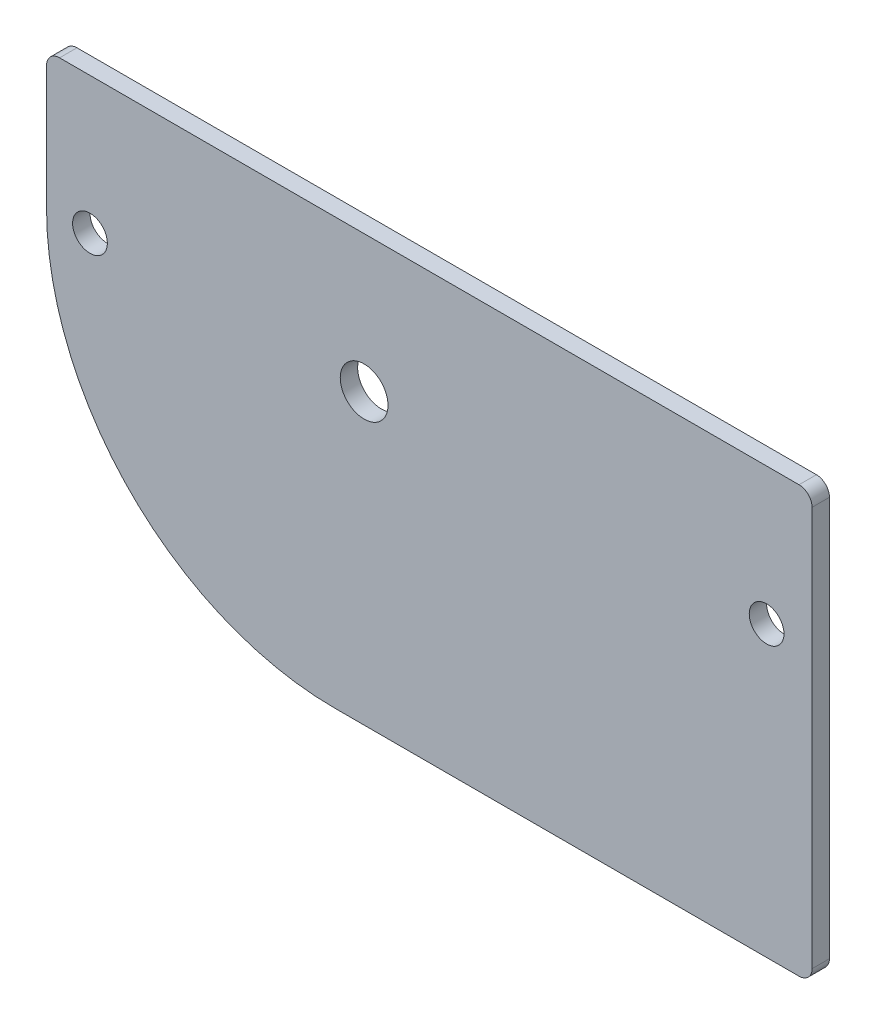
ISO-10303-21;
HEADER;
FILE_DESCRIPTION(('STEP AP214'),'2;1');
FILE_NAME('part.step','',(''),(''),'','','');
FILE_SCHEMA(('AUTOMOTIVE_DESIGN { 1 0 10303 214 1 1 1 1 }'));
ENDSEC;
DATA;
#1=APPLICATION_CONTEXT('core data for automotive mechanical design processes');
#2=APPLICATION_PROTOCOL_DEFINITION('international standard','automotive_design',2000,#1);
#3=PRODUCT_CONTEXT('',#1,'mechanical');
#4=PRODUCT('Part','Part','',(#3));
#5=PRODUCT_RELATED_PRODUCT_CATEGORY('part','',(#4));
#6=PRODUCT_DEFINITION_FORMATION('','',#4);
#7=PRODUCT_DEFINITION_CONTEXT('part definition',#1,'design');
#8=PRODUCT_DEFINITION('design','',#6,#7);
#9=PRODUCT_DEFINITION_SHAPE('','',#8);
#10=(LENGTH_UNIT() NAMED_UNIT(*) SI_UNIT(.MILLI.,.METRE.));
#11=(NAMED_UNIT(*) PLANE_ANGLE_UNIT() SI_UNIT($,.RADIAN.));
#12=(NAMED_UNIT(*) SI_UNIT($,.STERADIAN.) SOLID_ANGLE_UNIT());
#13=UNCERTAINTY_MEASURE_WITH_UNIT(LENGTH_MEASURE(1.E-05),#10,'distance_accuracy_value','');
#14=(GEOMETRIC_REPRESENTATION_CONTEXT(3) GLOBAL_UNCERTAINTY_ASSIGNED_CONTEXT((#13)) GLOBAL_UNIT_ASSIGNED_CONTEXT((#10,
#11,#12)) REPRESENTATION_CONTEXT('',''));
#15=CARTESIAN_POINT('',(0.,0.,0.));
#16=DIRECTION('',(0.,0.,1.));
#17=DIRECTION('',(1.,0.,0.));
#18=AXIS2_PLACEMENT_3D('',#15,#16,#17);
#19=CARTESIAN_POINT('',(58.5348506088101,-30.464729066858,2.));
#20=DIRECTION('',(0.,1.,0.));
#21=DIRECTION('',(0.,0.,1.));
#22=AXIS2_PLACEMENT_3D('',#19,#20,#21);
#23=PLANE('',#22);
#24=DIRECTION('',(0.,0.,-1.));
#25=VECTOR('',#24,1.);
#26=CARTESIAN_POINT('',(-25.3499377947,-30.464729066858,2.));
#27=LINE('',#26,#25);
#28=CARTESIAN_POINT('',(-25.3499377947,-30.464729066858,2.));
#29=VERTEX_POINT('',#28);
#30=CARTESIAN_POINT('',(-25.3499377947,-30.464729066858,0.));
#31=VERTEX_POINT('',#30);
#32=EDGE_CURVE('E105',#29,#31,#27,.T.);
#33=ORIENTED_EDGE('',*,*,#32,.T.);
#34=DIRECTION('',(1.,0.,0.));
#35=VECTOR('',#34,1.);
#36=CARTESIAN_POINT('',(58.5348506088101,-30.464729066858,0.));
#37=LINE('',#36,#35);
#38=CARTESIAN_POINT('',(28.0913613679258,-30.464729066858,0.));
#39=VERTEX_POINT('',#38);
#40=EDGE_CURVE('E61',#31,#39,#37,.T.);
#41=ORIENTED_EDGE('',*,*,#40,.T.);
#42=DIRECTION('',(0.,0.,-1.));
#43=VECTOR('',#42,1.);
#44=CARTESIAN_POINT('',(28.0913613679258,-30.464729066858,2.));
#45=LINE('',#44,#43);
#46=CARTESIAN_POINT('',(28.0913613679258,-30.464729066858,2.));
#47=VERTEX_POINT('',#46);
#48=EDGE_CURVE('E122',#47,#39,#45,.T.);
#49=ORIENTED_EDGE('',*,*,#48,.F.);
#50=DIRECTION('',(1.,0.,0.));
#51=VECTOR('',#50,1.);
#52=CARTESIAN_POINT('',(58.5348506088101,-30.464729066858,2.));
#53=LINE('',#52,#51);
#54=EDGE_CURVE('E46',#29,#47,#53,.T.);
#55=ORIENTED_EDGE('',*,*,#54,.F.);
#56=EDGE_LOOP('',(#33,#41,#49,#55));
#57=FACE_BOUND('',#56,.T.);
#58=ADVANCED_FACE('F38',(#57),#23,.F.);
#59=CARTESIAN_POINT('',(-58.5348506088101,30.464729066858,2.));
#60=DIRECTION('',(1.,0.,0.));
#61=DIRECTION('',(0.,0.,-1.));
#62=AXIS2_PLACEMENT_3D('',#59,#60,#61);
#63=PLANE('',#62);
#64=DIRECTION('',(0.,-1.,0.));
#65=VECTOR('',#64,1.);
#66=CARTESIAN_POINT('',(-58.5348506088101,30.464729066858,0.));
#67=LINE('',#66,#65);
#68=CARTESIAN_POINT('',(-58.5348506088101,17.035270933142,0.));
#69=VERTEX_POINT('',#68);
#70=CARTESIAN_POINT('',(-58.5348506088101,2.64527154538153,0.));
#71=VERTEX_POINT('',#70);
#72=EDGE_CURVE('E53',#69,#71,#67,.T.);
#73=ORIENTED_EDGE('',*,*,#72,.T.);
#74=DIRECTION('',(0.,0.,-1.));
#75=VECTOR('',#74,1.);
#76=CARTESIAN_POINT('',(-58.5348506088101,2.64527154538153,2.));
#77=LINE('',#76,#75);
#78=CARTESIAN_POINT('',(-58.5348506088101,2.64527154538153,2.));
#79=VERTEX_POINT('',#78);
#80=EDGE_CURVE('E111',#71,#79,#77,.F.);
#81=ORIENTED_EDGE('',*,*,#80,.T.);
#82=DIRECTION('',(0.,-1.,0.));
#83=VECTOR('',#82,1.);
#84=CARTESIAN_POINT('',(-58.5348506088101,30.464729066858,2.));
#85=LINE('',#84,#83);
#86=CARTESIAN_POINT('',(-58.5348506088101,17.035270933142,2.));
#87=VERTEX_POINT('',#86);
#88=EDGE_CURVE('E119',#87,#79,#85,.T.);
#89=ORIENTED_EDGE('',*,*,#88,.F.);
#90=DIRECTION('',(0.,0.,-1.));
#91=VECTOR('',#90,1.);
#92=CARTESIAN_POINT('',(-58.5348506088101,17.035270933142,2.));
#93=LINE('',#92,#91);
#94=EDGE_CURVE('E142',#87,#69,#93,.T.);
#95=ORIENTED_EDGE('',*,*,#94,.T.);
#96=EDGE_LOOP('',(#73,#81,#89,#95));
#97=FACE_BOUND('',#96,.T.);
#98=ADVANCED_FACE('F40',(#97),#63,.F.);
#99=CARTESIAN_POINT('',(0.,0.,2.));
#100=DIRECTION('',(0.,0.,-1.));
#101=DIRECTION('',(-1.,0.,0.));
#102=AXIS2_PLACEMENT_3D('',#99,#100,#101);
#103=PLANE('',#102);
#104=CARTESIAN_POINT('',(24.3575445079259,2.79458492910755,2.));
#105=DIRECTION('',(0.,0.,-1.));
#106=DIRECTION('',(-1.,0.,0.));
#107=AXIS2_PLACEMENT_3D('',#104,#105,#106);
#108=CIRCLE('',#107,2.);
#109=CARTESIAN_POINT('',(22.3575445079259,2.79458492910755,2.));
#110=VERTEX_POINT('',#109);
#111=EDGE_CURVE('E234',#110,#110,#108,.T.);
#112=ORIENTED_EDGE('',*,*,#111,.T.);
#113=EDGE_LOOP('',(#112));
#114=FACE_BOUND('',#113,.T.);
#115=CARTESIAN_POINT('',(-21.9748530502164,2.79526543997796,2.));
#116=DIRECTION('',(0.,0.,-1.));
#117=DIRECTION('',(-1.,0.,0.));
#118=AXIS2_PLACEMENT_3D('',#115,#116,#117);
#119=CIRCLE('',#118,2.75);
#120=CARTESIAN_POINT('',(-24.7248530502164,2.79526543997796,2.));
#121=VERTEX_POINT('',#120);
#122=EDGE_CURVE('E243',#121,#121,#119,.T.);
#123=ORIENTED_EDGE('',*,*,#122,.T.);
#124=EDGE_LOOP('',(#123));
#125=FACE_BOUND('',#124,.T.);
#126=CARTESIAN_POINT('',(-53.5348506088102,2.79458492910755,2.));
#127=DIRECTION('',(0.,0.,-1.));
#128=DIRECTION('',(-1.,0.,0.));
#129=AXIS2_PLACEMENT_3D('',#126,#127,#128);
#130=CIRCLE('',#129,2.);
#131=CARTESIAN_POINT('',(-55.5348506088102,2.79458492910755,2.));
#132=VERTEX_POINT('',#131);
#133=EDGE_CURVE('E120',#132,#132,#130,.T.);
#134=ORIENTED_EDGE('',*,*,#133,.T.);
#135=EDGE_LOOP('',(#134));
#136=FACE_BOUND('',#135,.T.);
#137=ORIENTED_EDGE('',*,*,#88,.T.);
#138=CARTESIAN_POINT('',(-25.3499377947,2.72026849261424,2.));
#139=DIRECTION('',(0.,0.,1.));
#140=DIRECTION('',(-1.,0.,0.));
#141=AXIS2_PLACEMENT_3D('',#138,#139,#140);
#142=CIRCLE('',#141,33.1849975594723);
#143=EDGE_CURVE('E108',#79,#29,#142,.T.);
#144=ORIENTED_EDGE('',*,*,#143,.T.);
#145=ORIENTED_EDGE('',*,*,#54,.T.);
#146=CARTESIAN_POINT('',(28.0913613679258,-28.964729066858,2.));
#147=DIRECTION('',(0.,0.,1.));
#148=DIRECTION('',(-1.,0.,0.));
#149=AXIS2_PLACEMENT_3D('',#146,#147,#148);
#150=CIRCLE('',#149,1.5);
#151=CARTESIAN_POINT('',(29.5913613679258,-28.964729066858,2.));
#152=VERTEX_POINT('',#151);
#153=EDGE_CURVE('E169',#47,#152,#150,.T.);
#154=ORIENTED_EDGE('',*,*,#153,.T.);
#155=DIRECTION('',(0.,1.,0.));
#156=VECTOR('',#155,1.);
#157=CARTESIAN_POINT('',(29.5913613679258,17.035270933142,2.));
#158=LINE('',#157,#156);
#159=CARTESIAN_POINT('',(29.5913613679258,17.035270933142,2.));
#160=VERTEX_POINT('',#159);
#161=EDGE_CURVE('E149',#152,#160,#158,.T.);
#162=ORIENTED_EDGE('',*,*,#161,.T.);
#163=CARTESIAN_POINT('',(28.0913613679258,17.035270933142,2.));
#164=DIRECTION('',(0.,0.,1.));
#165=DIRECTION('',(-1.,0.,0.));
#166=AXIS2_PLACEMENT_3D('',#163,#164,#165);
#167=CIRCLE('',#166,1.5);
#168=CARTESIAN_POINT('',(28.0913613679258,18.535270933142,2.));
#169=VERTEX_POINT('',#168);
#170=EDGE_CURVE('E145',#160,#169,#167,.T.);
#171=ORIENTED_EDGE('',*,*,#170,.T.);
#172=DIRECTION('',(-1.,0.,0.));
#173=VECTOR('',#172,1.);
#174=CARTESIAN_POINT('',(-57.0348506088101,18.535270933142,2.));
#175=LINE('',#174,#173);
#176=CARTESIAN_POINT('',(-57.0348506088101,18.535270933142,2.));
#177=VERTEX_POINT('',#176);
#178=EDGE_CURVE('E143',#169,#177,#175,.T.);
#179=ORIENTED_EDGE('',*,*,#178,.T.);
#180=CARTESIAN_POINT('',(-57.0348506088101,17.035270933142,2.));
#181=DIRECTION('',(0.,0.,1.));
#182=DIRECTION('',(-1.,0.,0.));
#183=AXIS2_PLACEMENT_3D('',#180,#181,#182);
#184=CIRCLE('',#183,1.5);
#185=EDGE_CURVE('E166',#177,#87,#184,.T.);
#186=ORIENTED_EDGE('',*,*,#185,.T.);
#187=EDGE_LOOP('',(#137,#144,#145,#154,#162,#171,#179,#186));
#188=FACE_BOUND('',#187,.T.);
#189=ADVANCED_FACE('F114',(#114,#125,#136,#188),#103,.F.);
#190=CARTESIAN_POINT('',(0.,0.,0.));
#191=DIRECTION('',(0.,0.,-1.));
#192=DIRECTION('',(-1.,0.,0.));
#193=AXIS2_PLACEMENT_3D('',#190,#191,#192);
#194=PLANE('',#193);
#195=CARTESIAN_POINT('',(24.3575445079259,2.79458492910755,0.));
#196=DIRECTION('',(0.,0.,-1.));
#197=DIRECTION('',(-1.,0.,0.));
#198=AXIS2_PLACEMENT_3D('',#195,#196,#197);
#199=CIRCLE('',#198,2.);
#200=CARTESIAN_POINT('',(22.3575445079259,2.79458492910755,0.));
#201=VERTEX_POINT('',#200);
#202=EDGE_CURVE('E237',#201,#201,#199,.T.);
#203=ORIENTED_EDGE('',*,*,#202,.F.);
#204=EDGE_LOOP('',(#203));
#205=FACE_BOUND('',#204,.T.);
#206=CARTESIAN_POINT('',(-21.9748530502164,2.79526543997796,0.));
#207=DIRECTION('',(0.,0.,-1.));
#208=DIRECTION('',(-1.,0.,0.));
#209=AXIS2_PLACEMENT_3D('',#206,#207,#208);
#210=CIRCLE('',#209,2.75);
#211=CARTESIAN_POINT('',(-24.7248530502164,2.79526543997796,0.));
#212=VERTEX_POINT('',#211);
#213=EDGE_CURVE('E240',#212,#212,#210,.T.);
#214=ORIENTED_EDGE('',*,*,#213,.F.);
#215=EDGE_LOOP('',(#214));
#216=FACE_BOUND('',#215,.T.);
#217=CARTESIAN_POINT('',(-53.5348506088102,2.79458492910755,0.));
#218=DIRECTION('',(0.,0.,-1.));
#219=DIRECTION('',(-1.,0.,0.));
#220=AXIS2_PLACEMENT_3D('',#217,#218,#219);
#221=CIRCLE('',#220,2.);
#222=CARTESIAN_POINT('',(-55.5348506088102,2.79458492910755,0.));
#223=VERTEX_POINT('',#222);
#224=EDGE_CURVE('E246',#223,#223,#221,.T.);
#225=ORIENTED_EDGE('',*,*,#224,.F.);
#226=EDGE_LOOP('',(#225));
#227=FACE_BOUND('',#226,.T.);
#228=CARTESIAN_POINT('',(-25.3499377947,2.72026849261424,0.));
#229=DIRECTION('',(0.,0.,-1.));
#230=DIRECTION('',(-1.,0.,0.));
#231=AXIS2_PLACEMENT_3D('',#228,#229,#230);
#232=CIRCLE('',#231,33.1849975594723);
#233=EDGE_CURVE('E11',#71,#31,#232,.F.);
#234=ORIENTED_EDGE('',*,*,#233,.F.);
#235=ORIENTED_EDGE('',*,*,#72,.F.);
#236=CARTESIAN_POINT('',(-57.0348506088101,17.035270933142,0.));
#237=DIRECTION('',(0.,0.,1.));
#238=DIRECTION('',(-1.,0.,0.));
#239=AXIS2_PLACEMENT_3D('',#236,#237,#238);
#240=CIRCLE('',#239,1.5);
#241=CARTESIAN_POINT('',(-57.0348506088101,18.535270933142,0.));
#242=VERTEX_POINT('',#241);
#243=EDGE_CURVE('E153',#242,#69,#240,.T.);
#244=ORIENTED_EDGE('',*,*,#243,.F.);
#245=DIRECTION('',(-1.,0.,0.));
#246=VECTOR('',#245,1.);
#247=CARTESIAN_POINT('',(-57.0348506088101,18.535270933142,0.));
#248=LINE('',#247,#246);
#249=CARTESIAN_POINT('',(28.0913613679258,18.535270933142,0.));
#250=VERTEX_POINT('',#249);
#251=EDGE_CURVE('E136',#250,#242,#248,.T.);
#252=ORIENTED_EDGE('',*,*,#251,.F.);
#253=CARTESIAN_POINT('',(28.0913613679258,17.035270933142,0.));
#254=DIRECTION('',(0.,0.,1.));
#255=DIRECTION('',(-1.,0.,0.));
#256=AXIS2_PLACEMENT_3D('',#253,#254,#255);
#257=CIRCLE('',#256,1.5);
#258=CARTESIAN_POINT('',(29.5913613679258,17.035270933142,0.));
#259=VERTEX_POINT('',#258);
#260=EDGE_CURVE('E161',#259,#250,#257,.T.);
#261=ORIENTED_EDGE('',*,*,#260,.F.);
#262=DIRECTION('',(0.,1.,0.));
#263=VECTOR('',#262,1.);
#264=CARTESIAN_POINT('',(29.5913613679258,17.035270933142,0.));
#265=LINE('',#264,#263);
#266=CARTESIAN_POINT('',(29.5913613679258,-28.964729066858,0.));
#267=VERTEX_POINT('',#266);
#268=EDGE_CURVE('E158',#267,#259,#265,.T.);
#269=ORIENTED_EDGE('',*,*,#268,.F.);
#270=CARTESIAN_POINT('',(28.0913613679258,-28.964729066858,0.));
#271=DIRECTION('',(0.,0.,1.));
#272=DIRECTION('',(-1.,0.,0.));
#273=AXIS2_PLACEMENT_3D('',#270,#271,#272);
#274=CIRCLE('',#273,1.5);
#275=EDGE_CURVE('E155',#39,#267,#274,.T.);
#276=ORIENTED_EDGE('',*,*,#275,.F.);
#277=ORIENTED_EDGE('',*,*,#40,.F.);
#278=EDGE_LOOP('',(#234,#235,#244,#252,#261,#269,#276,#277));
#279=FACE_BOUND('',#278,.T.);
#280=ADVANCED_FACE('F185',(#205,#216,#227,#279),#194,.T.);
#281=CARTESIAN_POINT('',(-57.0348506088101,17.035270933142,2.));
#282=DIRECTION('',(0.,0.,-1.));
#283=DIRECTION('',(-1.,0.,0.));
#284=AXIS2_PLACEMENT_3D('',#281,#282,#283);
#285=CYLINDRICAL_SURFACE('',#284,1.5);
#286=ORIENTED_EDGE('',*,*,#243,.T.);
#287=ORIENTED_EDGE('',*,*,#94,.F.);
#288=ORIENTED_EDGE('',*,*,#185,.F.);
#289=DIRECTION('',(0.,0.,-1.));
#290=VECTOR('',#289,1.);
#291=CARTESIAN_POINT('',(-57.0348506088101,18.535270933142,2.));
#292=LINE('',#291,#290);
#293=EDGE_CURVE('E127',#177,#242,#292,.T.);
#294=ORIENTED_EDGE('',*,*,#293,.T.);
#295=EDGE_LOOP('',(#286,#287,#288,#294));
#296=FACE_BOUND('',#295,.T.);
#297=ADVANCED_FACE('F183',(#296),#285,.T.);
#298=CARTESIAN_POINT('',(-57.0348506088101,18.535270933142,2.));
#299=DIRECTION('',(0.,-1.,0.));
#300=DIRECTION('',(0.,0.,-1.));
#301=AXIS2_PLACEMENT_3D('',#298,#299,#300);
#302=PLANE('',#301);
#303=ORIENTED_EDGE('',*,*,#251,.T.);
#304=ORIENTED_EDGE('',*,*,#293,.F.);
#305=ORIENTED_EDGE('',*,*,#178,.F.);
#306=DIRECTION('',(0.,0.,-1.));
#307=VECTOR('',#306,1.);
#308=CARTESIAN_POINT('',(28.0913613679258,18.535270933142,2.));
#309=LINE('',#308,#307);
#310=EDGE_CURVE('E128',#169,#250,#309,.T.);
#311=ORIENTED_EDGE('',*,*,#310,.T.);
#312=EDGE_LOOP('',(#303,#304,#305,#311));
#313=FACE_BOUND('',#312,.T.);
#314=ADVANCED_FACE('F182',(#313),#302,.F.);
#315=CARTESIAN_POINT('',(28.0913613679258,17.035270933142,2.));
#316=DIRECTION('',(0.,0.,-1.));
#317=DIRECTION('',(-1.,0.,0.));
#318=AXIS2_PLACEMENT_3D('',#315,#316,#317);
#319=CYLINDRICAL_SURFACE('',#318,1.5);
#320=ORIENTED_EDGE('',*,*,#260,.T.);
#321=ORIENTED_EDGE('',*,*,#310,.F.);
#322=ORIENTED_EDGE('',*,*,#170,.F.);
#323=DIRECTION('',(0.,0.,-1.));
#324=VECTOR('',#323,1.);
#325=CARTESIAN_POINT('',(29.5913613679258,17.035270933142,2.));
#326=LINE('',#325,#324);
#327=EDGE_CURVE('E133',#160,#259,#326,.T.);
#328=ORIENTED_EDGE('',*,*,#327,.T.);
#329=EDGE_LOOP('',(#320,#321,#322,#328));
#330=FACE_BOUND('',#329,.T.);
#331=ADVANCED_FACE('F181',(#330),#319,.T.);
#332=CARTESIAN_POINT('',(29.5913613679258,17.035270933142,2.));
#333=DIRECTION('',(-1.,0.,0.));
#334=DIRECTION('',(0.,0.,1.));
#335=AXIS2_PLACEMENT_3D('',#332,#333,#334);
#336=PLANE('',#335);
#337=ORIENTED_EDGE('',*,*,#268,.T.);
#338=ORIENTED_EDGE('',*,*,#327,.F.);
#339=ORIENTED_EDGE('',*,*,#161,.F.);
#340=DIRECTION('',(0.,0.,-1.));
#341=VECTOR('',#340,1.);
#342=CARTESIAN_POINT('',(29.5913613679258,-28.964729066858,2.));
#343=LINE('',#342,#341);
#344=EDGE_CURVE('E140',#152,#267,#343,.T.);
#345=ORIENTED_EDGE('',*,*,#344,.T.);
#346=EDGE_LOOP('',(#337,#338,#339,#345));
#347=FACE_BOUND('',#346,.T.);
#348=ADVANCED_FACE('F179',(#347),#336,.F.);
#349=CARTESIAN_POINT('',(28.0913613679258,-28.964729066858,2.));
#350=DIRECTION('',(0.,0.,-1.));
#351=DIRECTION('',(-1.,0.,0.));
#352=AXIS2_PLACEMENT_3D('',#349,#350,#351);
#353=CYLINDRICAL_SURFACE('',#352,1.5);
#354=ORIENTED_EDGE('',*,*,#275,.T.);
#355=ORIENTED_EDGE('',*,*,#344,.F.);
#356=ORIENTED_EDGE('',*,*,#153,.F.);
#357=ORIENTED_EDGE('',*,*,#48,.T.);
#358=EDGE_LOOP('',(#354,#355,#356,#357));
#359=FACE_BOUND('',#358,.T.);
#360=ADVANCED_FACE('F188',(#359),#353,.T.);
#361=CARTESIAN_POINT('',(-25.3499377947,2.72026849261424,2.));
#362=DIRECTION('',(0.,0.,-1.));
#363=DIRECTION('',(-1.,0.,0.));
#364=AXIS2_PLACEMENT_3D('',#361,#362,#363);
#365=CYLINDRICAL_SURFACE('',#364,33.1849975594723);
#366=ORIENTED_EDGE('',*,*,#233,.T.);
#367=ORIENTED_EDGE('',*,*,#32,.F.);
#368=ORIENTED_EDGE('',*,*,#143,.F.);
#369=ORIENTED_EDGE('',*,*,#80,.F.);
#370=EDGE_LOOP('',(#366,#367,#368,#369));
#371=FACE_BOUND('',#370,.T.);
#372=ADVANCED_FACE('F107',(#371),#365,.T.);
#373=CARTESIAN_POINT('',(-53.5348506088102,2.79458492910755,2.));
#374=DIRECTION('',(0.,0.,-1.));
#375=DIRECTION('',(-1.,0.,0.));
#376=AXIS2_PLACEMENT_3D('',#373,#374,#375);
#377=CYLINDRICAL_SURFACE('',#376,2.);
#378=ORIENTED_EDGE('',*,*,#133,.F.);
#379=EDGE_LOOP('',(#378));
#380=FACE_BOUND('',#379,.T.);
#381=ORIENTED_EDGE('',*,*,#224,.T.);
#382=EDGE_LOOP('',(#381));
#383=FACE_BOUND('',#382,.T.);
#384=ADVANCED_FACE('F195',(#380,#383),#377,.F.);
#385=CARTESIAN_POINT('',(-21.9748530502164,2.79526543997796,2.));
#386=DIRECTION('',(0.,0.,-1.));
#387=DIRECTION('',(-1.,0.,0.));
#388=AXIS2_PLACEMENT_3D('',#385,#386,#387);
#389=CYLINDRICAL_SURFACE('',#388,2.75);
#390=ORIENTED_EDGE('',*,*,#122,.F.);
#391=EDGE_LOOP('',(#390));
#392=FACE_BOUND('',#391,.T.);
#393=ORIENTED_EDGE('',*,*,#213,.T.);
#394=EDGE_LOOP('',(#393));
#395=FACE_BOUND('',#394,.T.);
#396=ADVANCED_FACE('F221',(#392,#395),#389,.F.);
#397=CARTESIAN_POINT('',(24.3575445079259,2.79458492910755,2.));
#398=DIRECTION('',(0.,0.,-1.));
#399=DIRECTION('',(-1.,0.,0.));
#400=AXIS2_PLACEMENT_3D('',#397,#398,#399);
#401=CYLINDRICAL_SURFACE('',#400,2.);
#402=ORIENTED_EDGE('',*,*,#111,.F.);
#403=EDGE_LOOP('',(#402));
#404=FACE_BOUND('',#403,.T.);
#405=ORIENTED_EDGE('',*,*,#202,.T.);
#406=EDGE_LOOP('',(#405));
#407=FACE_BOUND('',#406,.T.);
#408=ADVANCED_FACE('F225',(#404,#407),#401,.F.);
#409=CLOSED_SHELL('',(#58,#98,#189,#280,#297,#314,#331,#348,#360,#372,#384,#396,#408));
#410=MANIFOLD_SOLID_BREP('B2',#409);
#411=ADVANCED_BREP_SHAPE_REPRESENTATION('',(#18,#410),#14);
#412=SHAPE_DEFINITION_REPRESENTATION(#9,#411);
ENDSEC;
END-ISO-10303-21;
